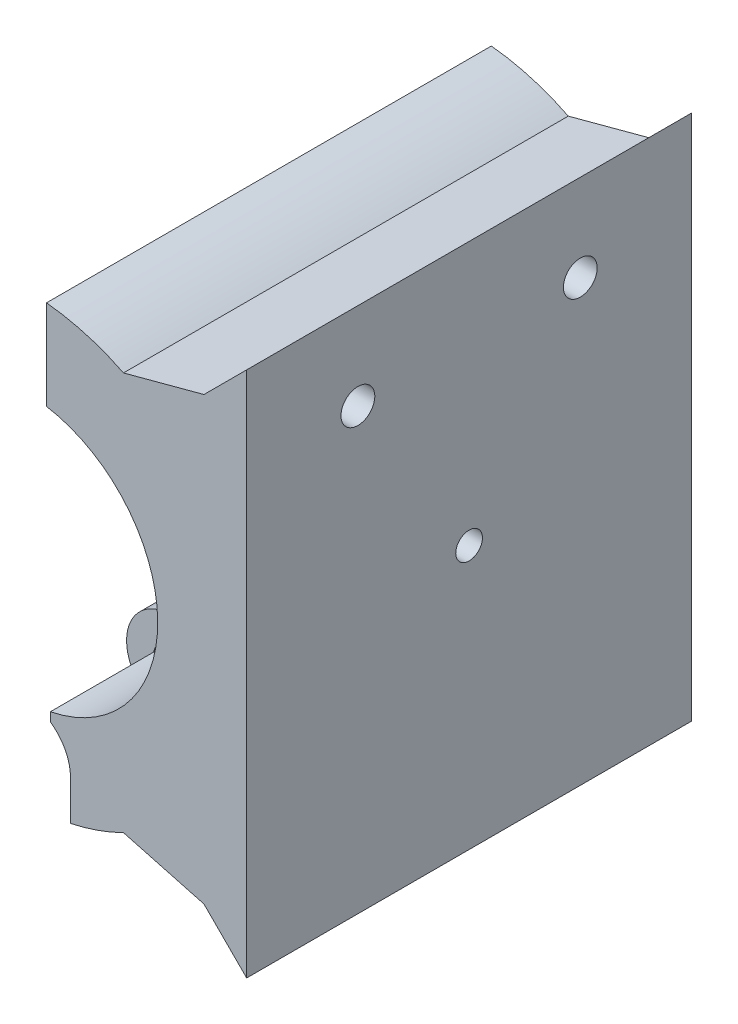
ISO-10303-21;
HEADER;
FILE_DESCRIPTION(('STEP AP214'),'2;1');
FILE_NAME('part.step','',(''),(''),'','','');
FILE_SCHEMA(('AUTOMOTIVE_DESIGN { 1 0 10303 214 1 1 1 1 }'));
ENDSEC;
DATA;
#1=APPLICATION_CONTEXT('core data for automotive mechanical design processes');
#2=APPLICATION_PROTOCOL_DEFINITION('international standard','automotive_design',2000,#1);
#3=PRODUCT_CONTEXT('',#1,'mechanical');
#4=PRODUCT('Part','Part','',(#3));
#5=PRODUCT_RELATED_PRODUCT_CATEGORY('part','',(#4));
#6=PRODUCT_DEFINITION_FORMATION('','',#4);
#7=PRODUCT_DEFINITION_CONTEXT('part definition',#1,'design');
#8=PRODUCT_DEFINITION('design','',#6,#7);
#9=PRODUCT_DEFINITION_SHAPE('','',#8);
#10=(LENGTH_UNIT() NAMED_UNIT(*) SI_UNIT(.MILLI.,.METRE.));
#11=(NAMED_UNIT(*) PLANE_ANGLE_UNIT() SI_UNIT($,.RADIAN.));
#12=(NAMED_UNIT(*) SI_UNIT($,.STERADIAN.) SOLID_ANGLE_UNIT());
#13=UNCERTAINTY_MEASURE_WITH_UNIT(LENGTH_MEASURE(1.E-05),#10,'distance_accuracy_value','');
#14=(GEOMETRIC_REPRESENTATION_CONTEXT(3) GLOBAL_UNCERTAINTY_ASSIGNED_CONTEXT((#13)) GLOBAL_UNIT_ASSIGNED_CONTEXT((#10,
#11,#12)) REPRESENTATION_CONTEXT('',''));
#15=CARTESIAN_POINT('',(0.,0.,0.));
#16=DIRECTION('',(0.,0.,1.));
#17=DIRECTION('',(1.,0.,0.));
#18=AXIS2_PLACEMENT_3D('',#15,#16,#17);
#19=CARTESIAN_POINT('',(0.,0.,50.));
#20=DIRECTION('',(0.,0.,-1.));
#21=DIRECTION('',(-1.,0.,0.));
#22=AXIS2_PLACEMENT_3D('',#19,#20,#21);
#23=CYLINDRICAL_SURFACE('',#22,15.);
#24=CARTESIAN_POINT('',(0.,0.,0.));
#25=DIRECTION('',(0.,0.,1.));
#26=DIRECTION('',(1.,0.,0.));
#27=AXIS2_PLACEMENT_3D('',#24,#25,#26);
#28=CIRCLE('',#27,15.);
#29=CARTESIAN_POINT('',(2.93792170309523,-14.7094736842105,0.));
#30=VERTEX_POINT('',#29);
#31=CARTESIAN_POINT('',(2.5,14.790199457749,0.));
#32=VERTEX_POINT('',#31);
#33=EDGE_CURVE('E183',#30,#32,#28,.T.);
#34=ORIENTED_EDGE('',*,*,#33,.F.);
#35=DIRECTION('',(0.,0.,-1.));
#36=VECTOR('',#35,1.);
#37=CARTESIAN_POINT('',(2.93792170309523,-14.7094736842105,16.5));
#38=LINE('',#37,#36);
#39=CARTESIAN_POINT('',(2.93792170309523,-14.7094736842105,16.5));
#40=VERTEX_POINT('',#39);
#41=EDGE_CURVE('E176',#40,#30,#38,.T.);
#42=ORIENTED_EDGE('',*,*,#41,.F.);
#43=CARTESIAN_POINT('',(0.,0.,16.5));
#44=DIRECTION('',(0.,0.,-1.));
#45=DIRECTION('',(-1.,0.,0.));
#46=AXIS2_PLACEMENT_3D('',#43,#44,#45);
#47=CIRCLE('',#46,15.);
#48=CARTESIAN_POINT('',(0.,-15.,16.5));
#49=VERTEX_POINT('',#48);
#50=EDGE_CURVE('E162',#40,#49,#47,.T.);
#51=ORIENTED_EDGE('',*,*,#50,.T.);
#52=DIRECTION('',(0.,0.,-1.));
#53=VECTOR('',#52,1.);
#54=CARTESIAN_POINT('',(0.,-15.,50.));
#55=LINE('',#54,#53);
#56=CARTESIAN_POINT('',(0.,-15.,33.5));
#57=VERTEX_POINT('',#56);
#58=EDGE_CURVE('E311',#57,#49,#55,.T.);
#59=ORIENTED_EDGE('',*,*,#58,.F.);
#60=CARTESIAN_POINT('',(0.,0.,33.5));
#61=DIRECTION('',(0.,0.,1.));
#62=DIRECTION('',(1.,0.,0.));
#63=AXIS2_PLACEMENT_3D('',#60,#61,#62);
#64=CIRCLE('',#63,15.);
#65=CARTESIAN_POINT('',(2.93792170309523,-14.7094736842105,33.5));
#66=VERTEX_POINT('',#65);
#67=EDGE_CURVE('E284',#57,#66,#64,.T.);
#68=ORIENTED_EDGE('',*,*,#67,.T.);
#69=DIRECTION('',(0.,0.,1.));
#70=VECTOR('',#69,1.);
#71=CARTESIAN_POINT('',(2.93792170309523,-14.7094736842105,33.5));
#72=LINE('',#71,#70);
#73=CARTESIAN_POINT('',(2.93792170309523,-14.7094736842105,50.));
#74=VERTEX_POINT('',#73);
#75=EDGE_CURVE('E194',#66,#74,#72,.T.);
#76=ORIENTED_EDGE('',*,*,#75,.T.);
#77=CARTESIAN_POINT('',(0.,0.,50.));
#78=DIRECTION('',(0.,0.,1.));
#79=DIRECTION('',(1.,0.,0.));
#80=AXIS2_PLACEMENT_3D('',#77,#78,#79);
#81=CIRCLE('',#80,15.);
#82=CARTESIAN_POINT('',(2.5,14.790199457749,50.));
#83=VERTEX_POINT('',#82);
#84=EDGE_CURVE('E286',#74,#83,#81,.T.);
#85=ORIENTED_EDGE('',*,*,#84,.T.);
#86=DIRECTION('',(0.,0.,-1.));
#87=VECTOR('',#86,1.);
#88=CARTESIAN_POINT('',(2.5,14.790199457749,50.));
#89=LINE('',#88,#87);
#90=EDGE_CURVE('E296',#83,#32,#89,.T.);
#91=ORIENTED_EDGE('',*,*,#90,.T.);
#92=EDGE_LOOP('',(#34,#42,#51,#59,#68,#76,#85,#91));
#93=FACE_BOUND('',#92,.T.);
#94=CARTESIAN_POINT('',(15.,0.,26.5));
#95=CARTESIAN_POINT('',(14.9999990328115,-0.084030530687339,26.4999963611494));
#96=CARTESIAN_POINT('',(14.9992863839431,-0.168116617751663,26.4929150966553));
#97=CARTESIAN_POINT('',(14.9965120139211,-0.333957597745259,26.4647734445644));
#98=CARTESIAN_POINT('',(14.9944488065104,-0.415709818753245,26.4436976559631));
#99=CARTESIAN_POINT('',(14.9892062184461,-0.574457513180125,26.3881866391033));
#100=CARTESIAN_POINT('',(14.9860275120106,-0.651455826922368,26.3537594792223));
#101=CARTESIAN_POINT('',(14.9789093609146,-0.798564241440614,26.2725386381025));
#102=CARTESIAN_POINT('',(14.974970067572,-0.868675708168618,26.2257474159998));
#103=CARTESIAN_POINT('',(14.9667561651199,-1.00028932601113,26.1209459535066));
#104=CARTESIAN_POINT('',(14.962480523608,-1.06176321725234,26.0629003008969));
#105=CARTESIAN_POINT('',(14.9540843535939,-1.17411378214648,25.9373131986055));
#106=CARTESIAN_POINT('',(14.9499638322738,-1.22498996562398,25.8697713099364));
#107=CARTESIAN_POINT('',(14.9423338732918,-1.31480095566543,25.7269322024746));
#108=CARTESIAN_POINT('',(14.9388257506636,-1.35371019818232,25.6516188338577));
#109=CARTESIAN_POINT('',(14.9328305631979,-1.41831957711414,25.4954866211425));
#110=CARTESIAN_POINT('',(14.9303434731333,-1.44402003988694,25.4146679131241));
#111=CARTESIAN_POINT('',(14.9266812610947,-1.48139856240284,25.250107298701));
#112=CARTESIAN_POINT('',(14.9255017559714,-1.4931234795057,25.1663761347217));
#113=CARTESIAN_POINT('',(14.9245746459079,-1.50236292770304,24.9981267049063));
#114=CARTESIAN_POINT('',(14.9248270033312,-1.49987783230621,24.9136084598169));
#115=CARTESIAN_POINT('',(14.926731103484,-1.48080642037902,24.74650703546));
#116=CARTESIAN_POINT('',(14.9283777688598,-1.46427126618683,24.663917951007));
#117=CARTESIAN_POINT('',(14.9328770143113,-1.41764871622588,24.5026930551984));
#118=CARTESIAN_POINT('',(14.9357296106774,-1.38756113738362,24.4240572972625));
#119=CARTESIAN_POINT('',(14.9423251417811,-1.31463134082226,24.2728096190517));
#120=CARTESIAN_POINT('',(14.9460696586224,-1.27176642407997,24.200208715766));
#121=CARTESIAN_POINT('',(14.9540257759932,-1.17451504102984,24.0632121776322));
#122=CARTESIAN_POINT('',(14.9582373901918,-1.12012823750476,23.9988167830274));
#123=CARTESIAN_POINT('',(14.9666757796948,-1.00109116861811,23.8797619090165));
#124=CARTESIAN_POINT('',(14.970902539995,-0.936396718277048,23.8251465971788));
#125=CARTESIAN_POINT('',(14.9788774361778,-0.798734222605672,23.7275445506344));
#126=CARTESIAN_POINT('',(14.9826255715238,-0.725766167999405,23.6845578289653));
#127=CARTESIAN_POINT('',(14.9892221350064,-0.57359715853855,23.6114349695346));
#128=CARTESIAN_POINT('',(14.9920704062215,-0.494395119584858,23.5813010727729));
#129=CARTESIAN_POINT('',(14.9965447116211,-0.332020825994901,23.5347716249324));
#130=CARTESIAN_POINT('',(14.9981707823559,-0.248848690164903,23.5183756630141));
#131=CARTESIAN_POINT('',(15.0000127750247,-0.0812776486378576,23.4998435383979));
#132=CARTESIAN_POINT('',(15.000234724016,0.00311445315823569,23.4976464276213));
#133=CARTESIAN_POINT('',(14.999259626352,0.171065689973547,23.5074142945731));
#134=CARTESIAN_POINT('',(14.998062598867,0.254624836230702,23.5193790809729));
#135=CARTESIAN_POINT('',(14.9943879230879,0.418362310252008,23.5570805431324));
#136=CARTESIAN_POINT('',(14.9919129287706,0.498547273458025,23.582788681717));
#137=CARTESIAN_POINT('',(14.9859599829091,0.653466482075669,23.6472177610559));
#138=CARTESIAN_POINT('',(14.9824820088788,0.728200605235673,23.6859389935591));
#139=CARTESIAN_POINT('',(14.9748971299563,0.870372270258211,23.7754462579959));
#140=CARTESIAN_POINT('',(14.9707881540516,0.937784489623373,23.8262723333887));
#141=CARTESIAN_POINT('',(14.9624089930428,1.06314243496781,23.9384891016114));
#142=CARTESIAN_POINT('',(14.9581388038946,1.12108792327376,23.9998800596055));
#143=CARTESIAN_POINT('',(14.9499003621113,1.22607916483072,24.1317498619885));
#144=CARTESIAN_POINT('',(14.9459332520846,1.27308491801931,24.2022606348139));
#145=CARTESIAN_POINT('',(14.9387674869133,1.35458738811574,24.35021104022));
#146=CARTESIAN_POINT('',(14.9355688212606,1.38908427608082,24.4276505780326));
#147=CARTESIAN_POINT('',(14.9303092145107,1.44452281302671,24.5871231091987));
#148=CARTESIAN_POINT('',(14.9282462767468,1.46548826221779,24.6691477601367));
#149=CARTESIAN_POINT('',(14.9254854792431,1.49334601069419,24.8355747969412));
#150=CARTESIAN_POINT('',(14.9247875803528,1.50023871359927,24.9199771145435));
#151=CARTESIAN_POINT('',(14.9248366966134,1.49974970770688,25.0883660325351));
#152=CARTESIAN_POINT('',(14.9255773513051,1.49243083438967,25.1723528243242));
#153=CARTESIAN_POINT('',(14.9284065583432,1.46385817944548,25.3378973757524));
#154=CARTESIAN_POINT('',(14.9304951122058,1.44260438214324,25.419455132659));
#155=CARTESIAN_POINT('',(14.9357830239478,1.38678252944625,25.5778260235718));
#156=CARTESIAN_POINT('',(14.9389822281054,1.35221631651137,25.6546398124446));
#157=CARTESIAN_POINT('',(14.9461312775904,1.27075733236656,25.8013853375066));
#158=CARTESIAN_POINT('',(14.9500811187143,1.22386463018312,25.8713171122309));
#159=CARTESIAN_POINT('',(14.9583073081455,1.11884783442799,26.0026355117079));
#160=CARTESIAN_POINT('',(14.9625849709013,1.0606769233354,26.0639846145506));
#161=CARTESIAN_POINT('',(14.9709728209317,0.934847548837661,26.1760783490495));
#162=CARTESIAN_POINT('',(14.9750829678446,0.867186816162382,26.2268204370358));
#163=CARTESIAN_POINT('',(14.9826834310374,0.724112151241931,26.3163601807819));
#164=CARTESIAN_POINT('',(14.9861721604022,0.648679124020143,26.3551274364178));
#165=CARTESIAN_POINT('',(14.9921194387484,0.492387418650823,26.4193936342358));
#166=CARTESIAN_POINT('',(14.9945791486448,0.411534974738411,26.4449075364303));
#167=CARTESIAN_POINT('',(14.997573206606,0.275187392108554,26.4755809256272));
#168=CARTESIAN_POINT('',(14.9984790103775,0.22056382926676,26.484725566449));
#169=CARTESIAN_POINT('',(14.9996927242618,0.110634871225966,26.4969362890926));
#170=CARTESIAN_POINT('',(15.0000006368404,0.0553294788398337,26.5000023959828));
#171=CARTESIAN_POINT('',(15.,0.,26.5));
#172=B_SPLINE_CURVE_WITH_KNOTS('',3,(#94,#95,#96,#97,#98,#99,#100,#101,#102,#103,#104,#105,#106,
#107,#108,#109,#110,#111,#112,#113,#114,#115,#116,#117,#118,#119,#120,#121,#122,#123,#124,#125,
#126,#127,#128,#129,#130,#131,#132,#133,#134,#135,#136,#137,#138,#139,#140,#141,#142,#143,#144,
#145,#146,#147,#148,#149,#150,#151,#152,#153,#154,#155,#156,#157,#158,#159,#160,#161,#162,#163,
#164,#165,#166,#167,#168,#169,#170,#171),.UNSPECIFIED.,.T.,.F.,(4,2,2,2,2,2,2,2,2,2,2,2,2,2,2,2,
2,2,2,2,2,2,2,2,2,2,2,2,2,2,2,2,2,2,2,2,2,2,4),(0.,0.251889549402711,0.504056764253229,
0.756071828598304,1.00803680637417,1.26080785293442,1.51359058831059,1.76690963208333,
2.02022241663756,2.27268348067795,2.52513790883665,2.77667696161666,3.0282194124245,
3.28021142059342,3.53221080496688,3.7853210129431,4.03843150469658,4.29158611040372,
4.54473314513159,4.79679282911637,5.04884910778715,5.30038402941457,5.551924590742,
5.80430911123048,6.05669996715345,6.30999965412898,6.56329587713062,6.81614535889505,
7.06898758859378,7.32071443940935,7.5724415733906,7.824133880442,8.0758247780844,
8.3285837614148,8.58140328955437,8.83485946539364,9.08802892192943,9.25388500848523,
9.41974041103541),.UNSPECIFIED.);
#173=CARTESIAN_POINT('',(15.,0.,26.5));
#174=VERTEX_POINT('',#173);
#175=EDGE_CURVE('E364',#174,#174,#172,.T.);
#176=ORIENTED_EDGE('',*,*,#175,.T.);
#177=EDGE_LOOP('',(#176));
#178=FACE_BOUND('',#177,.T.);
#179=ADVANCED_FACE('F38',(#93,#178),#23,.F.);
#180=CARTESIAN_POINT('',(0.,0.,0.));
#181=DIRECTION('',(0.,0.,1.));
#182=DIRECTION('',(1.,0.,0.));
#183=AXIS2_PLACEMENT_3D('',#180,#181,#182);
#184=PLANE('',#183);
#185=DIRECTION('',(0.,1.,0.));
#186=VECTOR('',#185,1.);
#187=CARTESIAN_POINT('',(2.93792170309523,0.,0.));
#188=LINE('',#187,#186);
#189=CARTESIAN_POINT('',(2.93792170309523,-15.7094736842105,0.));
#190=VERTEX_POINT('',#189);
#191=EDGE_CURVE('E178',#190,#30,#188,.T.);
#192=ORIENTED_EDGE('',*,*,#191,.T.);
#193=ORIENTED_EDGE('',*,*,#33,.T.);
#194=DIRECTION('',(0.,1.,0.));
#195=VECTOR('',#194,1.);
#196=CARTESIAN_POINT('',(2.5,0.,0.));
#197=LINE('',#196,#195);
#198=CARTESIAN_POINT('',(2.5,24.8746859276655,0.));
#199=VERTEX_POINT('',#198);
#200=EDGE_CURVE('E289',#32,#199,#197,.T.);
#201=ORIENTED_EDGE('',*,*,#200,.T.);
#202=CARTESIAN_POINT('',(0.,0.,0.));
#203=DIRECTION('',(0.,0.,1.));
#204=DIRECTION('',(1.,0.,0.));
#205=AXIS2_PLACEMENT_3D('',#202,#203,#204);
#206=CIRCLE('',#205,25.);
#207=CARTESIAN_POINT('',(11.1509972803674,22.3753270289674,0.));
#208=VERTEX_POINT('',#207);
#209=EDGE_CURVE('E298',#208,#199,#206,.T.);
#210=ORIENTED_EDGE('',*,*,#209,.F.);
#211=DIRECTION('',(0.965925826289069,0.258819045102518,0.));
#212=VECTOR('',#211,1.);
#213=CARTESIAN_POINT('',(20.2,24.8,0.));
#214=LINE('',#213,#212);
#215=CARTESIAN_POINT('',(20.2,24.8,0.));
#216=VERTEX_POINT('',#215);
#217=EDGE_CURVE('E202',#208,#216,#214,.T.);
#218=ORIENTED_EDGE('',*,*,#217,.T.);
#219=DIRECTION('',(0.707106781186545,0.70710678118655,0.));
#220=VECTOR('',#219,1.);
#221=CARTESIAN_POINT('',(20.2,24.8,0.));
#222=LINE('',#221,#220);
#223=CARTESIAN_POINT('',(25.,29.6,0.));
#224=VERTEX_POINT('',#223);
#225=EDGE_CURVE('E220',#216,#224,#222,.T.);
#226=ORIENTED_EDGE('',*,*,#225,.T.);
#227=DIRECTION('',(0.,-1.,0.));
#228=VECTOR('',#227,1.);
#229=CARTESIAN_POINT('',(25.,29.6,0.));
#230=LINE('',#229,#228);
#231=CARTESIAN_POINT('',(25.,-29.6,0.));
#232=VERTEX_POINT('',#231);
#233=EDGE_CURVE('E218',#224,#232,#230,.T.);
#234=ORIENTED_EDGE('',*,*,#233,.T.);
#235=DIRECTION('',(-0.707106781186545,0.70710678118655,0.));
#236=VECTOR('',#235,1.);
#237=CARTESIAN_POINT('',(20.2,-24.8,0.));
#238=LINE('',#237,#236);
#239=CARTESIAN_POINT('',(20.2,-24.8,0.));
#240=VERTEX_POINT('',#239);
#241=EDGE_CURVE('E215',#232,#240,#238,.T.);
#242=ORIENTED_EDGE('',*,*,#241,.T.);
#243=DIRECTION('',(-0.965925826289069,0.258819045102518,0.));
#244=VECTOR('',#243,1.);
#245=CARTESIAN_POINT('',(20.2,-24.8,0.));
#246=LINE('',#245,#244);
#247=CARTESIAN_POINT('',(11.1509972803673,-22.3753270289674,0.));
#248=VERTEX_POINT('',#247);
#249=EDGE_CURVE('E211',#240,#248,#246,.T.);
#250=ORIENTED_EDGE('',*,*,#249,.T.);
#251=CARTESIAN_POINT('',(5.2,-24.4532206467778,0.));
#252=VERTEX_POINT('',#251);
#253=EDGE_CURVE('E299',#252,#248,#206,.T.);
#254=ORIENTED_EDGE('',*,*,#253,.F.);
#255=DIRECTION('',(0.,-1.,0.));
#256=VECTOR('',#255,1.);
#257=CARTESIAN_POINT('',(5.2,0.,0.));
#258=LINE('',#257,#256);
#259=CARTESIAN_POINT('',(5.2,-20.,0.));
#260=VERTEX_POINT('',#259);
#261=EDGE_CURVE('E46',#260,#252,#258,.T.);
#262=ORIENTED_EDGE('',*,*,#261,.F.);
#263=CARTESIAN_POINT('',(0.,-20.,0.));
#264=DIRECTION('',(0.,0.,1.));
#265=DIRECTION('',(1.,0.,0.));
#266=AXIS2_PLACEMENT_3D('',#263,#264,#265);
#267=CIRCLE('',#266,5.2);
#268=EDGE_CURVE('E243',#260,#190,#267,.T.);
#269=ORIENTED_EDGE('',*,*,#268,.T.);
#270=EDGE_LOOP('',(#192,#193,#201,#210,#218,#226,#234,#242,#250,#254,#262,#269));
#271=FACE_BOUND('',#270,.T.);
#272=ADVANCED_FACE('F327',(#271),#184,.F.);
#273=CARTESIAN_POINT('',(0.,-20.,16.5));
#274=DIRECTION('',(0.,0.,-1.));
#275=DIRECTION('',(-1.,0.,0.));
#276=AXIS2_PLACEMENT_3D('',#273,#274,#275);
#277=CYLINDRICAL_SURFACE('',#276,5.2);
#278=CARTESIAN_POINT('',(0.,-20.,16.5));
#279=DIRECTION('',(0.,0.,1.));
#280=DIRECTION('',(1.,0.,0.));
#281=AXIS2_PLACEMENT_3D('',#278,#279,#280);
#282=CIRCLE('',#281,5.2);
#283=CARTESIAN_POINT('',(5.2,-20.,16.5));
#284=VERTEX_POINT('',#283);
#285=CARTESIAN_POINT('',(2.93792170309523,-15.7094736842105,16.5));
#286=VERTEX_POINT('',#285);
#287=EDGE_CURVE('E251',#284,#286,#282,.T.);
#288=ORIENTED_EDGE('',*,*,#287,.T.);
#289=DIRECTION('',(0.,0.,-1.));
#290=VECTOR('',#289,1.);
#291=CARTESIAN_POINT('',(2.93792170309523,-15.7094736842105,16.5));
#292=LINE('',#291,#290);
#293=EDGE_CURVE('E53',#286,#190,#292,.T.);
#294=ORIENTED_EDGE('',*,*,#293,.T.);
#295=ORIENTED_EDGE('',*,*,#268,.F.);
#296=DIRECTION('',(0.,0.,-1.));
#297=VECTOR('',#296,1.);
#298=CARTESIAN_POINT('',(5.2,-20.,16.5));
#299=LINE('',#298,#297);
#300=EDGE_CURVE('E255',#284,#260,#299,.T.);
#301=ORIENTED_EDGE('',*,*,#300,.F.);
#302=EDGE_LOOP('',(#288,#294,#295,#301));
#303=FACE_BOUND('',#302,.T.);
#304=ADVANCED_FACE('F413',(#303),#277,.F.);
#305=CARTESIAN_POINT('',(0.,0.,50.));
#306=DIRECTION('',(0.,0.,-1.));
#307=DIRECTION('',(-1.,0.,0.));
#308=AXIS2_PLACEMENT_3D('',#305,#306,#307);
#309=CYLINDRICAL_SURFACE('',#308,25.);
#310=CARTESIAN_POINT('',(0.,0.,50.));
#311=DIRECTION('',(0.,0.,1.));
#312=DIRECTION('',(1.,0.,0.));
#313=AXIS2_PLACEMENT_3D('',#310,#311,#312);
#314=CIRCLE('',#313,25.);
#315=CARTESIAN_POINT('',(11.1509972803674,22.3753270289674,50.));
#316=VERTEX_POINT('',#315);
#317=CARTESIAN_POINT('',(2.5,24.8746859276655,50.));
#318=VERTEX_POINT('',#317);
#319=EDGE_CURVE('E288',#316,#318,#314,.T.);
#320=ORIENTED_EDGE('',*,*,#319,.F.);
#321=DIRECTION('',(0.,0.,-1.));
#322=VECTOR('',#321,1.);
#323=CARTESIAN_POINT('',(11.1509972803674,22.3753270289674,110.798313104299));
#324=LINE('',#323,#322);
#325=EDGE_CURVE('E214',#316,#208,#324,.T.);
#326=ORIENTED_EDGE('',*,*,#325,.T.);
#327=ORIENTED_EDGE('',*,*,#209,.T.);
#328=DIRECTION('',(0.,0.,-1.));
#329=VECTOR('',#328,1.);
#330=CARTESIAN_POINT('',(2.5,24.8746859276655,50.));
#331=LINE('',#330,#329);
#332=EDGE_CURVE('E305',#318,#199,#331,.T.);
#333=ORIENTED_EDGE('',*,*,#332,.F.);
#334=EDGE_LOOP('',(#320,#326,#327,#333));
#335=FACE_BOUND('',#334,.T.);
#336=ADVANCED_FACE('F416',(#335),#309,.T.);
#337=CARTESIAN_POINT('',(0.,-20.,50.));
#338=DIRECTION('',(0.,0.,-1.));
#339=DIRECTION('',(-1.,0.,0.));
#340=AXIS2_PLACEMENT_3D('',#337,#338,#339);
#341=CYLINDRICAL_SURFACE('',#340,5.);
#342=CARTESIAN_POINT('',(0.,-20.,16.5));
#343=DIRECTION('',(0.,0.,-1.));
#344=DIRECTION('',(-1.,0.,0.));
#345=AXIS2_PLACEMENT_3D('',#342,#343,#344);
#346=CIRCLE('',#345,5.);
#347=CARTESIAN_POINT('',(0.,-25.,16.5));
#348=VERTEX_POINT('',#347);
#349=EDGE_CURVE('E168',#348,#49,#346,.T.);
#350=ORIENTED_EDGE('',*,*,#349,.F.);
#351=DIRECTION('',(0.,0.,-1.));
#352=VECTOR('',#351,1.);
#353=CARTESIAN_POINT('',(0.,-25.,50.));
#354=LINE('',#353,#352);
#355=CARTESIAN_POINT('',(0.,-25.,33.5));
#356=VERTEX_POINT('',#355);
#357=EDGE_CURVE('E308',#356,#348,#354,.T.);
#358=ORIENTED_EDGE('',*,*,#357,.F.);
#359=CARTESIAN_POINT('',(0.,-20.,33.5));
#360=DIRECTION('',(0.,0.,1.));
#361=DIRECTION('',(1.,0.,0.));
#362=AXIS2_PLACEMENT_3D('',#359,#360,#361);
#363=CIRCLE('',#362,5.);
#364=EDGE_CURVE('E282',#57,#356,#363,.T.);
#365=ORIENTED_EDGE('',*,*,#364,.F.);
#366=ORIENTED_EDGE('',*,*,#58,.T.);
#367=EDGE_LOOP('',(#350,#358,#365,#366));
#368=FACE_BOUND('',#367,.T.);
#369=ADVANCED_FACE('F352',(#368),#341,.T.);
#370=CARTESIAN_POINT('',(0.,-20.,50.));
#371=DIRECTION('',(0.,0.,-1.));
#372=DIRECTION('',(-1.,0.,0.));
#373=AXIS2_PLACEMENT_3D('',#370,#371,#372);
#374=CYLINDRICAL_SURFACE('',#373,2.);
#375=CARTESIAN_POINT('',(0.,-20.,33.5));
#376=DIRECTION('',(0.,0.,1.));
#377=DIRECTION('',(1.,0.,0.));
#378=AXIS2_PLACEMENT_3D('',#375,#376,#377);
#379=CIRCLE('',#378,2.);
#380=CARTESIAN_POINT('',(2.,-20.,33.5));
#381=VERTEX_POINT('',#380);
#382=EDGE_CURVE('E279',#381,#381,#379,.T.);
#383=ORIENTED_EDGE('',*,*,#382,.T.);
#384=EDGE_LOOP('',(#383));
#385=FACE_BOUND('',#384,.T.);
#386=CARTESIAN_POINT('',(0.,-20.,16.5));
#387=DIRECTION('',(0.,0.,-1.));
#388=DIRECTION('',(-1.,0.,0.));
#389=AXIS2_PLACEMENT_3D('',#386,#387,#388);
#390=CIRCLE('',#389,2.);
#391=CARTESIAN_POINT('',(-2.,-20.,16.5));
#392=VERTEX_POINT('',#391);
#393=EDGE_CURVE('E173',#392,#392,#390,.T.);
#394=ORIENTED_EDGE('',*,*,#393,.T.);
#395=EDGE_LOOP('',(#394));
#396=FACE_BOUND('',#395,.T.);
#397=ADVANCED_FACE('F429',(#385,#396),#374,.F.);
#398=ORIENTED_EDGE('',*,*,#253,.T.);
#399=DIRECTION('',(0.,0.,-1.));
#400=VECTOR('',#399,1.);
#401=CARTESIAN_POINT('',(11.1509972803673,-22.3753270289674,110.798313104299));
#402=LINE('',#401,#400);
#403=CARTESIAN_POINT('',(11.1509972803673,-22.3753270289674,50.));
#404=VERTEX_POINT('',#403);
#405=EDGE_CURVE('E226',#404,#248,#402,.T.);
#406=ORIENTED_EDGE('',*,*,#405,.F.);
#407=CARTESIAN_POINT('',(5.2,-24.4532206467778,50.));
#408=VERTEX_POINT('',#407);
#409=EDGE_CURVE('E290',#408,#404,#314,.T.);
#410=ORIENTED_EDGE('',*,*,#409,.F.);
#411=DIRECTION('',(0.,0.,-1.));
#412=VECTOR('',#411,1.);
#413=CARTESIAN_POINT('',(5.2,-24.4532206467778,50.));
#414=LINE('',#413,#412);
#415=CARTESIAN_POINT('',(5.2,-24.4532206467778,33.5));
#416=VERTEX_POINT('',#415);
#417=EDGE_CURVE('E276',#408,#416,#414,.T.);
#418=ORIENTED_EDGE('',*,*,#417,.T.);
#419=CARTESIAN_POINT('',(0.,0.,33.5));
#420=DIRECTION('',(0.,0.,1.));
#421=DIRECTION('',(1.,0.,0.));
#422=AXIS2_PLACEMENT_3D('',#419,#420,#421);
#423=CIRCLE('',#422,25.);
#424=EDGE_CURVE('E280',#356,#416,#423,.T.);
#425=ORIENTED_EDGE('',*,*,#424,.F.);
#426=ORIENTED_EDGE('',*,*,#357,.T.);
#427=CARTESIAN_POINT('',(0.,0.,16.5));
#428=DIRECTION('',(0.,0.,-1.));
#429=DIRECTION('',(-1.,0.,0.));
#430=AXIS2_PLACEMENT_3D('',#427,#428,#429);
#431=CIRCLE('',#430,25.);
#432=CARTESIAN_POINT('',(5.2,-24.4532206467778,16.5));
#433=VERTEX_POINT('',#432);
#434=EDGE_CURVE('E11',#433,#348,#431,.T.);
#435=ORIENTED_EDGE('',*,*,#434,.F.);
#436=DIRECTION('',(0.,0.,-1.));
#437=VECTOR('',#436,1.);
#438=CARTESIAN_POINT('',(5.2,-24.4532206467778,50.));
#439=LINE('',#438,#437);
#440=EDGE_CURVE('E260',#252,#433,#439,.F.);
#441=ORIENTED_EDGE('',*,*,#440,.F.);
#442=EDGE_LOOP('',(#398,#406,#410,#418,#425,#426,#435,#441));
#443=FACE_BOUND('',#442,.T.);
#444=ADVANCED_FACE('F326',(#443),#309,.T.);
#445=CARTESIAN_POINT('',(2.5,0.,50.));
#446=DIRECTION('',(-1.,0.,0.));
#447=DIRECTION('',(0.,0.,1.));
#448=AXIS2_PLACEMENT_3D('',#445,#446,#447);
#449=PLANE('',#448);
#450=CARTESIAN_POINT('',(2.5,19.8324426927073,37.5));
#451=DIRECTION('',(-1.,0.,0.));
#452=DIRECTION('',(0.,0.,1.));
#453=AXIS2_PLACEMENT_3D('',#450,#451,#452);
#454=CIRCLE('',#453,1.9);
#455=CARTESIAN_POINT('',(2.5,19.8324426927073,39.4));
#456=VERTEX_POINT('',#455);
#457=EDGE_CURVE('E203',#456,#456,#454,.T.);
#458=ORIENTED_EDGE('',*,*,#457,.F.);
#459=EDGE_LOOP('',(#458));
#460=FACE_BOUND('',#459,.T.);
#461=CARTESIAN_POINT('',(2.5,19.8324426927073,12.5));
#462=DIRECTION('',(-1.,0.,0.));
#463=DIRECTION('',(0.,0.,1.));
#464=AXIS2_PLACEMENT_3D('',#461,#462,#463);
#465=CIRCLE('',#464,1.9);
#466=CARTESIAN_POINT('',(2.5,19.8324426927073,14.4));
#467=VERTEX_POINT('',#466);
#468=EDGE_CURVE('E197',#467,#467,#465,.T.);
#469=ORIENTED_EDGE('',*,*,#468,.F.);
#470=EDGE_LOOP('',(#469));
#471=FACE_BOUND('',#470,.T.);
#472=ORIENTED_EDGE('',*,*,#200,.F.);
#473=ORIENTED_EDGE('',*,*,#90,.F.);
#474=DIRECTION('',(0.,1.,0.));
#475=VECTOR('',#474,1.);
#476=CARTESIAN_POINT('',(2.5,0.,50.));
#477=LINE('',#476,#475);
#478=EDGE_CURVE('E293',#83,#318,#477,.T.);
#479=ORIENTED_EDGE('',*,*,#478,.T.);
#480=ORIENTED_EDGE('',*,*,#332,.T.);
#481=EDGE_LOOP('',(#472,#473,#479,#480));
#482=FACE_BOUND('',#481,.T.);
#483=ADVANCED_FACE('F361',(#460,#471,#482),#449,.T.);
#484=CARTESIAN_POINT('',(0.,0.,50.));
#485=DIRECTION('',(0.,0.,1.));
#486=DIRECTION('',(1.,0.,0.));
#487=AXIS2_PLACEMENT_3D('',#484,#485,#486);
#488=PLANE('',#487);
#489=DIRECTION('',(0.,1.,0.));
#490=VECTOR('',#489,1.);
#491=CARTESIAN_POINT('',(2.93792170309523,0.,50.));
#492=LINE('',#491,#490);
#493=CARTESIAN_POINT('',(2.93792170309523,-15.7094736842105,50.));
#494=VERTEX_POINT('',#493);
#495=EDGE_CURVE('E185',#494,#74,#492,.T.);
#496=ORIENTED_EDGE('',*,*,#495,.F.);
#497=CARTESIAN_POINT('',(0.,-20.,50.));
#498=DIRECTION('',(0.,0.,1.));
#499=DIRECTION('',(1.,0.,0.));
#500=AXIS2_PLACEMENT_3D('',#497,#498,#499);
#501=CIRCLE('',#500,5.2);
#502=CARTESIAN_POINT('',(5.2,-20.,50.));
#503=VERTEX_POINT('',#502);
#504=EDGE_CURVE('E265',#503,#494,#501,.T.);
#505=ORIENTED_EDGE('',*,*,#504,.F.);
#506=DIRECTION('',(0.,1.,0.));
#507=VECTOR('',#506,1.);
#508=CARTESIAN_POINT('',(5.2,0.,50.));
#509=LINE('',#508,#507);
#510=EDGE_CURVE('E313',#408,#503,#509,.T.);
#511=ORIENTED_EDGE('',*,*,#510,.F.);
#512=ORIENTED_EDGE('',*,*,#409,.T.);
#513=DIRECTION('',(-0.965925826289069,0.258819045102518,0.));
#514=VECTOR('',#513,1.);
#515=CARTESIAN_POINT('',(20.2,-24.8,50.));
#516=LINE('',#515,#514);
#517=CARTESIAN_POINT('',(20.2,-24.8,50.));
#518=VERTEX_POINT('',#517);
#519=EDGE_CURVE('E61',#518,#404,#516,.T.);
#520=ORIENTED_EDGE('',*,*,#519,.F.);
#521=DIRECTION('',(-0.707106781186545,0.70710678118655,0.));
#522=VECTOR('',#521,1.);
#523=CARTESIAN_POINT('',(20.2,-24.8,50.));
#524=LINE('',#523,#522);
#525=CARTESIAN_POINT('',(25.,-29.6,50.));
#526=VERTEX_POINT('',#525);
#527=EDGE_CURVE('E228',#526,#518,#524,.T.);
#528=ORIENTED_EDGE('',*,*,#527,.F.);
#529=DIRECTION('',(0.,-1.,0.));
#530=VECTOR('',#529,1.);
#531=CARTESIAN_POINT('',(25.,29.6,50.));
#532=LINE('',#531,#530);
#533=CARTESIAN_POINT('',(25.,29.6,50.));
#534=VERTEX_POINT('',#533);
#535=EDGE_CURVE('E232',#534,#526,#532,.T.);
#536=ORIENTED_EDGE('',*,*,#535,.F.);
#537=DIRECTION('',(0.707106781186545,0.70710678118655,0.));
#538=VECTOR('',#537,1.);
#539=CARTESIAN_POINT('',(20.2,24.8,50.));
#540=LINE('',#539,#538);
#541=CARTESIAN_POINT('',(20.2,24.8,50.));
#542=VERTEX_POINT('',#541);
#543=EDGE_CURVE('E235',#542,#534,#540,.T.);
#544=ORIENTED_EDGE('',*,*,#543,.F.);
#545=DIRECTION('',(0.965925826289069,0.258819045102518,0.));
#546=VECTOR('',#545,1.);
#547=CARTESIAN_POINT('',(20.2,24.8,50.));
#548=LINE('',#547,#546);
#549=EDGE_CURVE('E239',#316,#542,#548,.T.);
#550=ORIENTED_EDGE('',*,*,#549,.F.);
#551=ORIENTED_EDGE('',*,*,#319,.T.);
#552=ORIENTED_EDGE('',*,*,#478,.F.);
#553=ORIENTED_EDGE('',*,*,#84,.F.);
#554=EDGE_LOOP('',(#496,#505,#511,#512,#520,#528,#536,#544,#550,#551,#552,#553));
#555=FACE_BOUND('',#554,.T.);
#556=ADVANCED_FACE('F335',(#555),#488,.T.);
#557=CARTESIAN_POINT('',(5.2,-25.2,33.5));
#558=DIRECTION('',(1.,0.,0.));
#559=DIRECTION('',(0.,1.,0.));
#560=AXIS2_PLACEMENT_3D('',#557,#558,#559);
#561=PLANE('',#560);
#562=ORIENTED_EDGE('',*,*,#510,.T.);
#563=DIRECTION('',(0.,0.,1.));
#564=VECTOR('',#563,1.);
#565=CARTESIAN_POINT('',(5.2,-20.,33.5));
#566=LINE('',#565,#564);
#567=CARTESIAN_POINT('',(5.2,-20.,33.5));
#568=VERTEX_POINT('',#567);
#569=EDGE_CURVE('E271',#568,#503,#566,.T.);
#570=ORIENTED_EDGE('',*,*,#569,.F.);
#571=DIRECTION('',(0.,1.,0.));
#572=VECTOR('',#571,1.);
#573=CARTESIAN_POINT('',(5.2,-25.2,33.5));
#574=LINE('',#573,#572);
#575=EDGE_CURVE('E269',#416,#568,#574,.T.);
#576=ORIENTED_EDGE('',*,*,#575,.F.);
#577=ORIENTED_EDGE('',*,*,#417,.F.);
#578=EDGE_LOOP('',(#562,#570,#576,#577));
#579=FACE_BOUND('',#578,.T.);
#580=ADVANCED_FACE('F340',(#579),#561,.F.);
#581=CARTESIAN_POINT('',(0.,-20.,33.5));
#582=DIRECTION('',(0.,0.,1.));
#583=DIRECTION('',(1.,0.,0.));
#584=AXIS2_PLACEMENT_3D('',#581,#582,#583);
#585=CYLINDRICAL_SURFACE('',#584,5.2);
#586=ORIENTED_EDGE('',*,*,#504,.T.);
#587=DIRECTION('',(0.,0.,1.));
#588=VECTOR('',#587,1.);
#589=CARTESIAN_POINT('',(2.93792170309523,-15.7094736842105,33.5));
#590=LINE('',#589,#588);
#591=CARTESIAN_POINT('',(2.93792170309523,-15.7094736842105,33.5));
#592=VERTEX_POINT('',#591);
#593=EDGE_CURVE('E192',#592,#494,#590,.T.);
#594=ORIENTED_EDGE('',*,*,#593,.F.);
#595=CARTESIAN_POINT('',(0.,-20.,33.5));
#596=DIRECTION('',(0.,0.,1.));
#597=DIRECTION('',(1.,0.,0.));
#598=AXIS2_PLACEMENT_3D('',#595,#596,#597);
#599=CIRCLE('',#598,5.2);
#600=EDGE_CURVE('E266',#568,#592,#599,.T.);
#601=ORIENTED_EDGE('',*,*,#600,.F.);
#602=ORIENTED_EDGE('',*,*,#569,.T.);
#603=EDGE_LOOP('',(#586,#594,#601,#602));
#604=FACE_BOUND('',#603,.T.);
#605=ADVANCED_FACE('F344',(#604),#585,.F.);
#606=CARTESIAN_POINT('',(0.,-20.,33.5));
#607=DIRECTION('',(0.,0.,1.));
#608=DIRECTION('',(1.,0.,0.));
#609=AXIS2_PLACEMENT_3D('',#606,#607,#608);
#610=PLANE('',#609);
#611=ORIENTED_EDGE('',*,*,#382,.F.);
#612=EDGE_LOOP('',(#611));
#613=FACE_BOUND('',#612,.T.);
#614=ORIENTED_EDGE('',*,*,#364,.T.);
#615=ORIENTED_EDGE('',*,*,#424,.T.);
#616=ORIENTED_EDGE('',*,*,#575,.T.);
#617=ORIENTED_EDGE('',*,*,#600,.T.);
#618=DIRECTION('',(0.,1.,0.));
#619=VECTOR('',#618,1.);
#620=CARTESIAN_POINT('',(2.93792170309523,0.,33.5));
#621=LINE('',#620,#619);
#622=EDGE_CURVE('E189',#592,#66,#621,.T.);
#623=ORIENTED_EDGE('',*,*,#622,.T.);
#624=ORIENTED_EDGE('',*,*,#67,.F.);
#625=EDGE_LOOP('',(#614,#615,#616,#617,#623,#624));
#626=FACE_BOUND('',#625,.T.);
#627=ADVANCED_FACE('F347',(#613,#626),#610,.T.);
#628=CARTESIAN_POINT('',(5.2,-25.2,16.5));
#629=DIRECTION('',(-1.,0.,0.));
#630=DIRECTION('',(0.,-1.,0.));
#631=AXIS2_PLACEMENT_3D('',#628,#629,#630);
#632=PLANE('',#631);
#633=ORIENTED_EDGE('',*,*,#440,.T.);
#634=DIRECTION('',(0.,1.,0.));
#635=VECTOR('',#634,1.);
#636=CARTESIAN_POINT('',(5.2,-25.2,16.5));
#637=LINE('',#636,#635);
#638=EDGE_CURVE('E253',#433,#284,#637,.T.);
#639=ORIENTED_EDGE('',*,*,#638,.T.);
#640=ORIENTED_EDGE('',*,*,#300,.T.);
#641=ORIENTED_EDGE('',*,*,#261,.T.);
#642=EDGE_LOOP('',(#633,#639,#640,#641));
#643=FACE_BOUND('',#642,.T.);
#644=ADVANCED_FACE('F319',(#643),#632,.T.);
#645=CARTESIAN_POINT('',(0.,-20.,16.5));
#646=DIRECTION('',(0.,0.,-1.));
#647=DIRECTION('',(1.,0.,0.));
#648=AXIS2_PLACEMENT_3D('',#645,#646,#647);
#649=PLANE('',#648);
#650=ORIENTED_EDGE('',*,*,#393,.F.);
#651=EDGE_LOOP('',(#650));
#652=FACE_BOUND('',#651,.T.);
#653=ORIENTED_EDGE('',*,*,#287,.F.);
#654=ORIENTED_EDGE('',*,*,#638,.F.);
#655=ORIENTED_EDGE('',*,*,#434,.T.);
#656=ORIENTED_EDGE('',*,*,#349,.T.);
#657=ORIENTED_EDGE('',*,*,#50,.F.);
#658=DIRECTION('',(0.,1.,0.));
#659=VECTOR('',#658,1.);
#660=CARTESIAN_POINT('',(2.93792170309523,0.,16.5));
#661=LINE('',#660,#659);
#662=EDGE_CURVE('E165',#286,#40,#661,.T.);
#663=ORIENTED_EDGE('',*,*,#662,.F.);
#664=EDGE_LOOP('',(#653,#654,#655,#656,#657,#663));
#665=FACE_BOUND('',#664,.T.);
#666=ADVANCED_FACE('F164',(#652,#665),#649,.T.);
#667=CARTESIAN_POINT('',(25.,29.6,110.798313104299));
#668=DIRECTION('',(1.,0.,0.));
#669=DIRECTION('',(0.,1.,0.));
#670=AXIS2_PLACEMENT_3D('',#667,#668,#669);
#671=PLANE('',#670);
#672=CARTESIAN_POINT('',(25.,0.,25.));
#673=DIRECTION('',(1.,0.,0.));
#674=DIRECTION('',(0.,0.,-1.));
#675=AXIS2_PLACEMENT_3D('',#672,#673,#674);
#676=CIRCLE('',#675,1.5);
#677=CARTESIAN_POINT('',(25.,0.,23.5));
#678=VERTEX_POINT('',#677);
#679=EDGE_CURVE('E366',#678,#678,#676,.T.);
#680=ORIENTED_EDGE('',*,*,#679,.F.);
#681=EDGE_LOOP('',(#680));
#682=FACE_BOUND('',#681,.T.);
#683=CARTESIAN_POINT('',(25.,19.8324426927073,37.5));
#684=DIRECTION('',(-1.,0.,0.));
#685=DIRECTION('',(0.,0.,1.));
#686=AXIS2_PLACEMENT_3D('',#683,#684,#685);
#687=CIRCLE('',#686,1.9);
#688=CARTESIAN_POINT('',(25.,19.8324426927073,39.4));
#689=VERTEX_POINT('',#688);
#690=EDGE_CURVE('E199',#689,#689,#687,.T.);
#691=ORIENTED_EDGE('',*,*,#690,.T.);
#692=EDGE_LOOP('',(#691));
#693=FACE_BOUND('',#692,.T.);
#694=CARTESIAN_POINT('',(25.,19.8324426927073,12.5));
#695=DIRECTION('',(-1.,0.,0.));
#696=DIRECTION('',(0.,0.,1.));
#697=AXIS2_PLACEMENT_3D('',#694,#695,#696);
#698=CIRCLE('',#697,1.9);
#699=CARTESIAN_POINT('',(25.,19.8324426927073,14.4));
#700=VERTEX_POINT('',#699);
#701=EDGE_CURVE('E206',#700,#700,#698,.T.);
#702=ORIENTED_EDGE('',*,*,#701,.T.);
#703=EDGE_LOOP('',(#702));
#704=FACE_BOUND('',#703,.T.);
#705=DIRECTION('',(0.,0.,-1.));
#706=VECTOR('',#705,1.);
#707=CARTESIAN_POINT('',(25.,-29.6,110.798313104299));
#708=LINE('',#707,#706);
#709=EDGE_CURVE('E231',#526,#232,#708,.T.);
#710=ORIENTED_EDGE('',*,*,#709,.T.);
#711=ORIENTED_EDGE('',*,*,#233,.F.);
#712=DIRECTION('',(0.,0.,-1.));
#713=VECTOR('',#712,1.);
#714=CARTESIAN_POINT('',(25.,29.6,110.798313104299));
#715=LINE('',#714,#713);
#716=EDGE_CURVE('E234',#534,#224,#715,.T.);
#717=ORIENTED_EDGE('',*,*,#716,.F.);
#718=ORIENTED_EDGE('',*,*,#535,.T.);
#719=EDGE_LOOP('',(#710,#711,#717,#718));
#720=FACE_BOUND('',#719,.T.);
#721=ADVANCED_FACE('F397',(#682,#693,#704,#720),#671,.T.);
#722=CARTESIAN_POINT('',(20.2,24.8,110.798313104299));
#723=DIRECTION('',(-0.258819045102518,0.965925826289069,0.));
#724=DIRECTION('',(-0.965925826289069,-0.258819045102518,0.));
#725=AXIS2_PLACEMENT_3D('',#722,#723,#724);
#726=PLANE('',#725);
#727=ORIENTED_EDGE('',*,*,#325,.F.);
#728=ORIENTED_EDGE('',*,*,#549,.T.);
#729=DIRECTION('',(0.,0.,-1.));
#730=VECTOR('',#729,1.);
#731=CARTESIAN_POINT('',(20.2,24.8,110.798313104299));
#732=LINE('',#731,#730);
#733=EDGE_CURVE('E238',#542,#216,#732,.T.);
#734=ORIENTED_EDGE('',*,*,#733,.T.);
#735=ORIENTED_EDGE('',*,*,#217,.F.);
#736=EDGE_LOOP('',(#727,#728,#734,#735));
#737=FACE_BOUND('',#736,.T.);
#738=ADVANCED_FACE('F400',(#737),#726,.T.);
#739=CARTESIAN_POINT('',(20.2,24.8,110.798313104299));
#740=DIRECTION('',(-0.70710678118655,0.707106781186545,0.));
#741=DIRECTION('',(-0.707106781186545,-0.70710678118655,0.));
#742=AXIS2_PLACEMENT_3D('',#739,#740,#741);
#743=PLANE('',#742);
#744=ORIENTED_EDGE('',*,*,#733,.F.);
#745=ORIENTED_EDGE('',*,*,#543,.T.);
#746=ORIENTED_EDGE('',*,*,#716,.T.);
#747=ORIENTED_EDGE('',*,*,#225,.F.);
#748=EDGE_LOOP('',(#744,#745,#746,#747));
#749=FACE_BOUND('',#748,.T.);
#750=ADVANCED_FACE('F395',(#749),#743,.T.);
#751=CARTESIAN_POINT('',(20.2,-24.8,110.798313104299));
#752=DIRECTION('',(-0.70710678118655,-0.707106781186545,0.));
#753=DIRECTION('',(0.707106781186545,-0.70710678118655,0.));
#754=AXIS2_PLACEMENT_3D('',#751,#752,#753);
#755=PLANE('',#754);
#756=ORIENTED_EDGE('',*,*,#709,.F.);
#757=ORIENTED_EDGE('',*,*,#527,.T.);
#758=DIRECTION('',(0.,0.,-1.));
#759=VECTOR('',#758,1.);
#760=CARTESIAN_POINT('',(20.2,-24.8,110.798313104299));
#761=LINE('',#760,#759);
#762=EDGE_CURVE('E227',#518,#240,#761,.T.);
#763=ORIENTED_EDGE('',*,*,#762,.T.);
#764=ORIENTED_EDGE('',*,*,#241,.F.);
#765=EDGE_LOOP('',(#756,#757,#763,#764));
#766=FACE_BOUND('',#765,.T.);
#767=ADVANCED_FACE('F392',(#766),#755,.T.);
#768=CARTESIAN_POINT('',(20.2,-24.8,110.798313104299));
#769=DIRECTION('',(-0.258819045102518,-0.965925826289069,0.));
#770=DIRECTION('',(0.965925826289069,-0.258819045102518,0.));
#771=AXIS2_PLACEMENT_3D('',#768,#769,#770);
#772=PLANE('',#771);
#773=ORIENTED_EDGE('',*,*,#762,.F.);
#774=ORIENTED_EDGE('',*,*,#519,.T.);
#775=ORIENTED_EDGE('',*,*,#405,.T.);
#776=ORIENTED_EDGE('',*,*,#249,.F.);
#777=EDGE_LOOP('',(#773,#774,#775,#776));
#778=FACE_BOUND('',#777,.T.);
#779=ADVANCED_FACE('F330',(#778),#772,.T.);
#780=CARTESIAN_POINT('',(25.,19.8324426927073,12.5));
#781=DIRECTION('',(-1.,0.,0.));
#782=DIRECTION('',(0.,0.,1.));
#783=AXIS2_PLACEMENT_3D('',#780,#781,#782);
#784=CYLINDRICAL_SURFACE('',#783,1.9);
#785=ORIENTED_EDGE('',*,*,#701,.F.);
#786=EDGE_LOOP('',(#785));
#787=FACE_BOUND('',#786,.T.);
#788=ORIENTED_EDGE('',*,*,#468,.T.);
#789=EDGE_LOOP('',(#788));
#790=FACE_BOUND('',#789,.T.);
#791=ADVANCED_FACE('F385',(#787,#790),#784,.F.);
#792=CARTESIAN_POINT('',(25.,19.8324426927073,37.5));
#793=DIRECTION('',(-1.,0.,0.));
#794=DIRECTION('',(0.,0.,1.));
#795=AXIS2_PLACEMENT_3D('',#792,#793,#794);
#796=CYLINDRICAL_SURFACE('',#795,1.9);
#797=ORIENTED_EDGE('',*,*,#690,.F.);
#798=EDGE_LOOP('',(#797));
#799=FACE_BOUND('',#798,.T.);
#800=ORIENTED_EDGE('',*,*,#457,.T.);
#801=EDGE_LOOP('',(#800));
#802=FACE_BOUND('',#801,.T.);
#803=ADVANCED_FACE('F382',(#799,#802),#796,.F.);
#804=CARTESIAN_POINT('',(2.93792170309523,0.,33.5));
#805=DIRECTION('',(1.,0.,0.));
#806=DIRECTION('',(0.,0.,-1.));
#807=AXIS2_PLACEMENT_3D('',#804,#805,#806);
#808=PLANE('',#807);
#809=ORIENTED_EDGE('',*,*,#495,.T.);
#810=ORIENTED_EDGE('',*,*,#75,.F.);
#811=ORIENTED_EDGE('',*,*,#622,.F.);
#812=ORIENTED_EDGE('',*,*,#593,.T.);
#813=EDGE_LOOP('',(#809,#810,#811,#812));
#814=FACE_BOUND('',#813,.T.);
#815=ADVANCED_FACE('F356',(#814),#808,.F.);
#816=CARTESIAN_POINT('',(2.93792170309523,0.,16.5));
#817=DIRECTION('',(-1.,0.,0.));
#818=DIRECTION('',(0.,0.,1.));
#819=AXIS2_PLACEMENT_3D('',#816,#817,#818);
#820=PLANE('',#819);
#821=ORIENTED_EDGE('',*,*,#191,.F.);
#822=ORIENTED_EDGE('',*,*,#293,.F.);
#823=ORIENTED_EDGE('',*,*,#662,.T.);
#824=ORIENTED_EDGE('',*,*,#41,.T.);
#825=EDGE_LOOP('',(#821,#822,#823,#824));
#826=FACE_BOUND('',#825,.T.);
#827=ADVANCED_FACE('F175',(#826),#820,.T.);
#828=CARTESIAN_POINT('',(25.,0.,25.));
#829=DIRECTION('',(-1.,0.,0.));
#830=DIRECTION('',(0.,0.,1.));
#831=AXIS2_PLACEMENT_3D('',#828,#829,#830);
#832=CYLINDRICAL_SURFACE('',#831,1.5);
#833=ORIENTED_EDGE('',*,*,#175,.F.);
#834=EDGE_LOOP('',(#833));
#835=FACE_BOUND('',#834,.T.);
#836=ORIENTED_EDGE('',*,*,#679,.T.);
#837=EDGE_LOOP('',(#836));
#838=FACE_BOUND('',#837,.T.);
#839=ADVANCED_FACE('F373',(#835,#838),#832,.F.);
#840=CLOSED_SHELL('',(#179,#272,#304,#336,#369,#397,#444,#483,#556,#580,#605,#627,#644,#666,
#721,#738,#750,#767,#779,#791,#803,#815,#827,#839));
#841=MANIFOLD_SOLID_BREP('B2',#840);
#842=ADVANCED_BREP_SHAPE_REPRESENTATION('',(#18,#841),#14);
#843=SHAPE_DEFINITION_REPRESENTATION(#9,#842);
ENDSEC;
END-ISO-10303-21;
